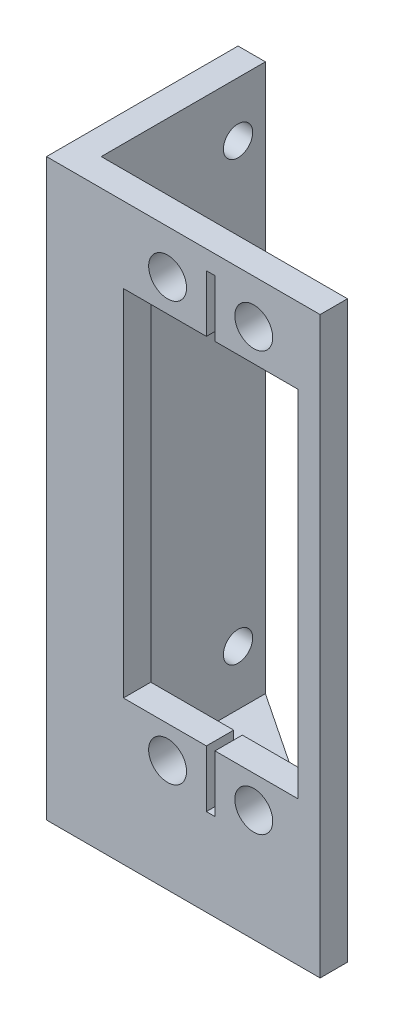
ISO-10303-21;
HEADER;
FILE_DESCRIPTION(('STEP AP214'),'2;1');
FILE_NAME('part.step','',(''),(''),'','','');
FILE_SCHEMA(('AUTOMOTIVE_DESIGN { 1 0 10303 214 1 1 1 1 }'));
ENDSEC;
DATA;
#1=APPLICATION_CONTEXT('core data for automotive mechanical design processes');
#2=APPLICATION_PROTOCOL_DEFINITION('international standard','automotive_design',2000,#1);
#3=PRODUCT_CONTEXT('',#1,'mechanical');
#4=PRODUCT('Part','Part','',(#3));
#5=PRODUCT_RELATED_PRODUCT_CATEGORY('part','',(#4));
#6=PRODUCT_DEFINITION_FORMATION('','',#4);
#7=PRODUCT_DEFINITION_CONTEXT('part definition',#1,'design');
#8=PRODUCT_DEFINITION('design','',#6,#7);
#9=PRODUCT_DEFINITION_SHAPE('','',#8);
#10=(LENGTH_UNIT() NAMED_UNIT(*) SI_UNIT(.MILLI.,.METRE.));
#11=(NAMED_UNIT(*) PLANE_ANGLE_UNIT() SI_UNIT($,.RADIAN.));
#12=(NAMED_UNIT(*) SI_UNIT($,.STERADIAN.) SOLID_ANGLE_UNIT());
#13=UNCERTAINTY_MEASURE_WITH_UNIT(LENGTH_MEASURE(1.E-05),#10,'distance_accuracy_value','');
#14=(GEOMETRIC_REPRESENTATION_CONTEXT(3) GLOBAL_UNCERTAINTY_ASSIGNED_CONTEXT((#13)) GLOBAL_UNIT_ASSIGNED_CONTEXT((#10,
#11,#12)) REPRESENTATION_CONTEXT('',''));
#15=CARTESIAN_POINT('',(0.,0.,0.));
#16=DIRECTION('',(0.,0.,1.));
#17=DIRECTION('',(1.,0.,0.));
#18=AXIS2_PLACEMENT_3D('',#15,#16,#17);
#19=CARTESIAN_POINT('',(31.75,0.,3.175));
#20=DIRECTION('',(-1.,0.,0.));
#21=DIRECTION('',(0.,-1.,0.));
#22=AXIS2_PLACEMENT_3D('',#19,#20,#21);
#23=PLANE('',#22);
#24=DIRECTION('',(0.,1.,0.));
#25=VECTOR('',#24,1.);
#26=CARTESIAN_POINT('',(31.75,0.,0.));
#27=LINE('',#26,#25);
#28=CARTESIAN_POINT('',(31.75,0.,0.));
#29=VERTEX_POINT('',#28);
#30=CARTESIAN_POINT('',(31.75,63.5,0.));
#31=VERTEX_POINT('',#30);
#32=EDGE_CURVE('E348',#29,#31,#27,.T.);
#33=ORIENTED_EDGE('',*,*,#32,.T.);
#34=DIRECTION('',(0.,0.,-1.));
#35=VECTOR('',#34,1.);
#36=CARTESIAN_POINT('',(31.75,63.5,3.175));
#37=LINE('',#36,#35);
#38=CARTESIAN_POINT('',(31.75,63.5,3.175));
#39=VERTEX_POINT('',#38);
#40=EDGE_CURVE('E11',#39,#31,#37,.T.);
#41=ORIENTED_EDGE('',*,*,#40,.F.);
#42=DIRECTION('',(0.,1.,0.));
#43=VECTOR('',#42,1.);
#44=CARTESIAN_POINT('',(31.75,0.,3.175));
#45=LINE('',#44,#43);
#46=CARTESIAN_POINT('',(31.75,-3.175,3.175));
#47=VERTEX_POINT('',#46);
#48=EDGE_CURVE('E338',#47,#39,#45,.T.);
#49=ORIENTED_EDGE('',*,*,#48,.F.);
#50=DIRECTION('',(0.,0.,1.));
#51=VECTOR('',#50,1.);
#52=CARTESIAN_POINT('',(31.75,-3.175,3.175));
#53=LINE('',#52,#51);
#54=CARTESIAN_POINT('',(31.75,-3.175,0.));
#55=VERTEX_POINT('',#54);
#56=EDGE_CURVE('E204',#55,#47,#53,.T.);
#57=ORIENTED_EDGE('',*,*,#56,.F.);
#58=DIRECTION('',(0.,1.,0.));
#59=VECTOR('',#58,1.);
#60=CARTESIAN_POINT('',(31.75,-3.175,0.));
#61=LINE('',#60,#59);
#62=EDGE_CURVE('E206',#55,#29,#61,.T.);
#63=ORIENTED_EDGE('',*,*,#62,.T.);
#64=EDGE_LOOP('',(#33,#41,#49,#57,#63));
#65=FACE_BOUND('',#64,.T.);
#66=ADVANCED_FACE('F37',(#65),#23,.F.);
#67=CARTESIAN_POINT('',(0.,63.5,3.175));
#68=DIRECTION('',(0.,1.,0.));
#69=DIRECTION('',(0.,0.,1.));
#70=AXIS2_PLACEMENT_3D('',#67,#68,#69);
#71=PLANE('',#70);
#72=DIRECTION('',(1.,0.,0.));
#73=VECTOR('',#72,1.);
#74=CARTESIAN_POINT('',(0.,63.5,0.));
#75=LINE('',#74,#73);
#76=CARTESIAN_POINT('',(3.175,63.5,0.));
#77=VERTEX_POINT('',#76);
#78=EDGE_CURVE('E341',#77,#31,#75,.T.);
#79=ORIENTED_EDGE('',*,*,#78,.F.);
#80=DIRECTION('',(0.,0.,1.));
#81=VECTOR('',#80,1.);
#82=CARTESIAN_POINT('',(3.175,63.5,-19.05));
#83=LINE('',#82,#81);
#84=CARTESIAN_POINT('',(3.175,63.5,-19.05));
#85=VERTEX_POINT('',#84);
#86=EDGE_CURVE('E51',#85,#77,#83,.T.);
#87=ORIENTED_EDGE('',*,*,#86,.F.);
#88=DIRECTION('',(-1.,0.,0.));
#89=VECTOR('',#88,1.);
#90=CARTESIAN_POINT('',(0.,63.5,-19.05));
#91=LINE('',#90,#89);
#92=CARTESIAN_POINT('',(0.,63.5,-19.05));
#93=VERTEX_POINT('',#92);
#94=EDGE_CURVE('E212',#85,#93,#91,.T.);
#95=ORIENTED_EDGE('',*,*,#94,.T.);
#96=DIRECTION('',(0.,0.,-1.));
#97=VECTOR('',#96,1.);
#98=CARTESIAN_POINT('',(0.,63.5,3.175));
#99=LINE('',#98,#97);
#100=CARTESIAN_POINT('',(0.,63.5,3.175));
#101=VERTEX_POINT('',#100);
#102=EDGE_CURVE('E44',#101,#93,#99,.T.);
#103=ORIENTED_EDGE('',*,*,#102,.F.);
#104=DIRECTION('',(1.,0.,0.));
#105=VECTOR('',#104,1.);
#106=CARTESIAN_POINT('',(0.,63.5,3.175));
#107=LINE('',#106,#105);
#108=EDGE_CURVE('E340',#101,#39,#107,.T.);
#109=ORIENTED_EDGE('',*,*,#108,.T.);
#110=ORIENTED_EDGE('',*,*,#40,.T.);
#111=EDGE_LOOP('',(#79,#87,#95,#103,#109,#110));
#112=FACE_BOUND('',#111,.T.);
#113=ADVANCED_FACE('F357',(#112),#71,.T.);
#114=CARTESIAN_POINT('',(0.,0.,3.175));
#115=DIRECTION('',(-1.,0.,0.));
#116=DIRECTION('',(0.,-1.,0.));
#117=AXIS2_PLACEMENT_3D('',#114,#115,#116);
#118=PLANE('',#117);
#119=CARTESIAN_POINT('',(0.,6.35,-3.175));
#120=DIRECTION('',(1.,0.,0.));
#121=DIRECTION('',(0.,1.,0.));
#122=AXIS2_PLACEMENT_3D('',#119,#120,#121);
#123=CIRCLE('',#122,1.700000029);
#124=CARTESIAN_POINT('',(0.,8.050000029,-3.175));
#125=VERTEX_POINT('',#124);
#126=EDGE_CURVE('E775',#125,#125,#123,.T.);
#127=ORIENTED_EDGE('',*,*,#126,.T.);
#128=EDGE_LOOP('',(#127));
#129=FACE_BOUND('',#128,.T.);
#130=CARTESIAN_POINT('',(0.,57.15,-15.875));
#131=DIRECTION('',(1.,0.,0.));
#132=DIRECTION('',(0.,1.,0.));
#133=AXIS2_PLACEMENT_3D('',#130,#131,#132);
#134=CIRCLE('',#133,1.700000029);
#135=CARTESIAN_POINT('',(0.,58.850000029,-15.875));
#136=VERTEX_POINT('',#135);
#137=EDGE_CURVE('E789',#136,#136,#134,.T.);
#138=ORIENTED_EDGE('',*,*,#137,.T.);
#139=EDGE_LOOP('',(#138));
#140=FACE_BOUND('',#139,.T.);
#141=CARTESIAN_POINT('',(0.,6.35,-15.875));
#142=DIRECTION('',(1.,0.,0.));
#143=DIRECTION('',(0.,1.,0.));
#144=AXIS2_PLACEMENT_3D('',#141,#142,#143);
#145=CIRCLE('',#144,1.700000029);
#146=CARTESIAN_POINT('',(0.,8.050000029,-15.875));
#147=VERTEX_POINT('',#146);
#148=EDGE_CURVE('E784',#147,#147,#145,.T.);
#149=ORIENTED_EDGE('',*,*,#148,.T.);
#150=EDGE_LOOP('',(#149));
#151=FACE_BOUND('',#150,.T.);
#152=CARTESIAN_POINT('',(0.,57.15,-3.175));
#153=DIRECTION('',(1.,0.,0.));
#154=DIRECTION('',(0.,1.,0.));
#155=AXIS2_PLACEMENT_3D('',#152,#153,#154);
#156=CIRCLE('',#155,1.700000029);
#157=CARTESIAN_POINT('',(0.,58.850000029,-3.175));
#158=VERTEX_POINT('',#157);
#159=EDGE_CURVE('E197',#158,#158,#156,.T.);
#160=ORIENTED_EDGE('',*,*,#159,.T.);
#161=EDGE_LOOP('',(#160));
#162=FACE_BOUND('',#161,.T.);
#163=ORIENTED_EDGE('',*,*,#102,.T.);
#164=DIRECTION('',(0.,-1.,0.));
#165=VECTOR('',#164,1.);
#166=CARTESIAN_POINT('',(0.,0.,-19.05));
#167=LINE('',#166,#165);
#168=CARTESIAN_POINT('',(0.,-3.175,-19.05));
#169=VERTEX_POINT('',#168);
#170=EDGE_CURVE('E167',#93,#169,#167,.T.);
#171=ORIENTED_EDGE('',*,*,#170,.T.);
#172=DIRECTION('',(0.,0.,-1.));
#173=VECTOR('',#172,1.);
#174=CARTESIAN_POINT('',(0.,-3.175,-19.05));
#175=LINE('',#174,#173);
#176=CARTESIAN_POINT('',(0.,-3.175,3.175));
#177=VERTEX_POINT('',#176);
#178=EDGE_CURVE('E172',#177,#169,#175,.T.);
#179=ORIENTED_EDGE('',*,*,#178,.F.);
#180=DIRECTION('',(0.,1.,0.));
#181=VECTOR('',#180,1.);
#182=CARTESIAN_POINT('',(0.,0.,3.175));
#183=LINE('',#182,#181);
#184=EDGE_CURVE('E344',#177,#101,#183,.T.);
#185=ORIENTED_EDGE('',*,*,#184,.T.);
#186=EDGE_LOOP('',(#163,#171,#179,#185));
#187=FACE_BOUND('',#186,.T.);
#188=ADVANCED_FACE('F169',(#129,#140,#151,#162,#187),#118,.T.);
#189=CARTESIAN_POINT('',(0.,0.,3.175));
#190=DIRECTION('',(0.,0.,1.));
#191=DIRECTION('',(1.,0.,0.));
#192=AXIS2_PLACEMENT_3D('',#189,#190,#191);
#193=PLANE('',#192);
#194=CARTESIAN_POINT('',(24.050000033,9.82700003100002,3.175));
#195=DIRECTION('',(0.,0.,1.));
#196=DIRECTION('',(1.,0.,0.));
#197=AXIS2_PLACEMENT_3D('',#194,#195,#196);
#198=CIRCLE('',#197,2.200000045);
#199=CARTESIAN_POINT('',(26.250000078,9.82700003100002,3.175));
#200=VERTEX_POINT('',#199);
#201=EDGE_CURVE('E320',#200,#200,#198,.T.);
#202=ORIENTED_EDGE('',*,*,#201,.F.);
#203=EDGE_LOOP('',(#202));
#204=FACE_BOUND('',#203,.T.);
#205=CARTESIAN_POINT('',(14.049999967,58.427000113,3.175));
#206=DIRECTION('',(0.,0.,1.));
#207=DIRECTION('',(1.,0.,0.));
#208=AXIS2_PLACEMENT_3D('',#205,#206,#207);
#209=CIRCLE('',#208,2.200000045);
#210=CARTESIAN_POINT('',(16.250000012,58.427000113,3.175));
#211=VERTEX_POINT('',#210);
#212=EDGE_CURVE('E327',#211,#211,#209,.T.);
#213=ORIENTED_EDGE('',*,*,#212,.F.);
#214=EDGE_LOOP('',(#213));
#215=FACE_BOUND('',#214,.T.);
#216=DIRECTION('',(0.,-1.,0.));
#217=VECTOR('',#216,1.);
#218=CARTESIAN_POINT('',(8.923000061,54.704000066,3.175));
#219=LINE('',#218,#217);
#220=CARTESIAN_POINT('',(8.923000061,54.704000066,3.175));
#221=VERTEX_POINT('',#220);
#222=CARTESIAN_POINT('',(8.923000061,13.550000078,3.175));
#223=VERTEX_POINT('',#222);
#224=EDGE_CURVE('E59',#221,#223,#219,.T.);
#225=ORIENTED_EDGE('',*,*,#224,.F.);
#226=DIRECTION('',(-1.,0.,0.));
#227=VECTOR('',#226,1.);
#228=CARTESIAN_POINT('',(8.923000061,54.704000066,3.175));
#229=LINE('',#228,#227);
#230=CARTESIAN_POINT('',(18.55,54.704000066,3.175));
#231=VERTEX_POINT('',#230);
#232=EDGE_CURVE('E244',#231,#221,#229,.T.);
#233=ORIENTED_EDGE('',*,*,#232,.F.);
#234=DIRECTION('',(0.,-1.,0.));
#235=VECTOR('',#234,1.);
#236=CARTESIAN_POINT('',(18.55,54.704000066,3.175));
#237=LINE('',#236,#235);
#238=CARTESIAN_POINT('',(18.55,61.308000066,3.175));
#239=VERTEX_POINT('',#238);
#240=EDGE_CURVE('E247',#239,#231,#237,.T.);
#241=ORIENTED_EDGE('',*,*,#240,.F.);
#242=DIRECTION('',(-1.,0.,0.));
#243=VECTOR('',#242,1.);
#244=CARTESIAN_POINT('',(18.55,61.308000066,3.175));
#245=LINE('',#244,#243);
#246=CARTESIAN_POINT('',(19.55,61.308000066,3.175));
#247=VERTEX_POINT('',#246);
#248=EDGE_CURVE('E251',#247,#239,#245,.T.);
#249=ORIENTED_EDGE('',*,*,#248,.F.);
#250=DIRECTION('',(0.,1.,0.));
#251=VECTOR('',#250,1.);
#252=CARTESIAN_POINT('',(19.55,54.704000066,3.175));
#253=LINE('',#252,#251);
#254=CARTESIAN_POINT('',(19.55,54.704000066,3.175));
#255=VERTEX_POINT('',#254);
#256=EDGE_CURVE('E254',#255,#247,#253,.T.);
#257=ORIENTED_EDGE('',*,*,#256,.F.);
#258=DIRECTION('',(-1.,0.,0.));
#259=VECTOR('',#258,1.);
#260=CARTESIAN_POINT('',(19.55,54.704000066,3.175));
#261=LINE('',#260,#259);
#262=CARTESIAN_POINT('',(29.176999939,54.704000066,3.175));
#263=VERTEX_POINT('',#262);
#264=EDGE_CURVE('E257',#263,#255,#261,.T.);
#265=ORIENTED_EDGE('',*,*,#264,.F.);
#266=DIRECTION('',(0.,1.,0.));
#267=VECTOR('',#266,1.);
#268=CARTESIAN_POINT('',(29.176999939,54.704000066,3.175));
#269=LINE('',#268,#267);
#270=CARTESIAN_POINT('',(29.176999939,13.550000078,3.175));
#271=VERTEX_POINT('',#270);
#272=EDGE_CURVE('E260',#271,#263,#269,.T.);
#273=ORIENTED_EDGE('',*,*,#272,.F.);
#274=DIRECTION('',(1.,0.,0.));
#275=VECTOR('',#274,1.);
#276=CARTESIAN_POINT('',(19.55,13.550000078,3.175));
#277=LINE('',#276,#275);
#278=CARTESIAN_POINT('',(19.55,13.550000078,3.175));
#279=VERTEX_POINT('',#278);
#280=EDGE_CURVE('E263',#279,#271,#277,.T.);
#281=ORIENTED_EDGE('',*,*,#280,.F.);
#282=DIRECTION('',(0.,1.,0.));
#283=VECTOR('',#282,1.);
#284=CARTESIAN_POINT('',(19.55,13.550000078,3.175));
#285=LINE('',#284,#283);
#286=CARTESIAN_POINT('',(19.55,6.94600007800001,3.175));
#287=VERTEX_POINT('',#286);
#288=EDGE_CURVE('E266',#287,#279,#285,.T.);
#289=ORIENTED_EDGE('',*,*,#288,.F.);
#290=DIRECTION('',(1.,0.,0.));
#291=VECTOR('',#290,1.);
#292=CARTESIAN_POINT('',(18.55,6.94600007800004,3.175));
#293=LINE('',#292,#291);
#294=CARTESIAN_POINT('',(18.55,6.94600007800004,3.175));
#295=VERTEX_POINT('',#294);
#296=EDGE_CURVE('E269',#295,#287,#293,.T.);
#297=ORIENTED_EDGE('',*,*,#296,.F.);
#298=DIRECTION('',(0.,-1.,0.));
#299=VECTOR('',#298,1.);
#300=CARTESIAN_POINT('',(18.55,13.550000078,3.175));
#301=LINE('',#300,#299);
#302=CARTESIAN_POINT('',(18.55,13.550000078,3.175));
#303=VERTEX_POINT('',#302);
#304=EDGE_CURVE('E272',#303,#295,#301,.T.);
#305=ORIENTED_EDGE('',*,*,#304,.F.);
#306=DIRECTION('',(1.,0.,0.));
#307=VECTOR('',#306,1.);
#308=CARTESIAN_POINT('',(8.923000061,13.550000078,3.175));
#309=LINE('',#308,#307);
#310=EDGE_CURVE('E275',#223,#303,#309,.T.);
#311=ORIENTED_EDGE('',*,*,#310,.F.);
#312=EDGE_LOOP('',(#225,#233,#241,#249,#257,#265,#273,#281,#289,#297,#305,#311));
#313=FACE_BOUND('',#312,.T.);
#314=CARTESIAN_POINT('',(24.050000033,58.427000113,3.175));
#315=DIRECTION('',(0.,0.,1.));
#316=DIRECTION('',(1.,0.,0.));
#317=AXIS2_PLACEMENT_3D('',#314,#315,#316);
#318=CIRCLE('',#317,2.200000045);
#319=CARTESIAN_POINT('',(26.250000078,58.427000113,3.175));
#320=VERTEX_POINT('',#319);
#321=EDGE_CURVE('E314',#320,#320,#318,.T.);
#322=ORIENTED_EDGE('',*,*,#321,.F.);
#323=EDGE_LOOP('',(#322));
#324=FACE_BOUND('',#323,.T.);
#325=CARTESIAN_POINT('',(14.049999967,9.82700003100002,3.175));
#326=DIRECTION('',(0.,0.,1.));
#327=DIRECTION('',(1.,0.,0.));
#328=AXIS2_PLACEMENT_3D('',#325,#326,#327);
#329=CIRCLE('',#328,2.200000045);
#330=CARTESIAN_POINT('',(16.250000012,9.82700003100002,3.175));
#331=VERTEX_POINT('',#330);
#332=EDGE_CURVE('E323',#331,#331,#329,.T.);
#333=ORIENTED_EDGE('',*,*,#332,.F.);
#334=EDGE_LOOP('',(#333));
#335=FACE_BOUND('',#334,.T.);
#336=ORIENTED_EDGE('',*,*,#184,.F.);
#337=DIRECTION('',(-1.,0.,0.));
#338=VECTOR('',#337,1.);
#339=CARTESIAN_POINT('',(0.,-3.175,3.175));
#340=LINE('',#339,#338);
#341=EDGE_CURVE('E193',#47,#177,#340,.T.);
#342=ORIENTED_EDGE('',*,*,#341,.F.);
#343=ORIENTED_EDGE('',*,*,#48,.T.);
#344=ORIENTED_EDGE('',*,*,#108,.F.);
#345=EDGE_LOOP('',(#336,#342,#343,#344));
#346=FACE_BOUND('',#345,.T.);
#347=ADVANCED_FACE('F369',(#204,#215,#313,#324,#335,#346),#193,.T.);
#348=CARTESIAN_POINT('',(0.,0.,0.));
#349=DIRECTION('',(0.,0.,1.));
#350=DIRECTION('',(1.,0.,0.));
#351=AXIS2_PLACEMENT_3D('',#348,#349,#350);
#352=PLANE('',#351);
#353=CARTESIAN_POINT('',(24.050000033,9.82700003100002,0.));
#354=DIRECTION('',(0.,0.,1.));
#355=DIRECTION('',(1.,0.,0.));
#356=AXIS2_PLACEMENT_3D('',#353,#354,#355);
#357=CIRCLE('',#356,2.200000045);
#358=CARTESIAN_POINT('',(26.250000078,9.82700003100002,0.));
#359=VERTEX_POINT('',#358);
#360=EDGE_CURVE('E324',#359,#359,#357,.T.);
#361=ORIENTED_EDGE('',*,*,#360,.T.);
#362=EDGE_LOOP('',(#361));
#363=FACE_BOUND('',#362,.T.);
#364=CARTESIAN_POINT('',(14.049999967,58.427000113,0.));
#365=DIRECTION('',(0.,0.,1.));
#366=DIRECTION('',(1.,0.,0.));
#367=AXIS2_PLACEMENT_3D('',#364,#365,#366);
#368=CIRCLE('',#367,2.200000045);
#369=CARTESIAN_POINT('',(16.250000012,58.427000113,0.));
#370=VERTEX_POINT('',#369);
#371=EDGE_CURVE('E317',#370,#370,#368,.T.);
#372=ORIENTED_EDGE('',*,*,#371,.T.);
#373=EDGE_LOOP('',(#372));
#374=FACE_BOUND('',#373,.T.);
#375=DIRECTION('',(-1.,0.,0.));
#376=VECTOR('',#375,1.);
#377=CARTESIAN_POINT('',(8.923000061,54.704000066,0.));
#378=LINE('',#377,#376);
#379=CARTESIAN_POINT('',(18.55,54.704000066,0.));
#380=VERTEX_POINT('',#379);
#381=CARTESIAN_POINT('',(8.923000061,54.704000066,0.));
#382=VERTEX_POINT('',#381);
#383=EDGE_CURVE('E222',#380,#382,#378,.T.);
#384=ORIENTED_EDGE('',*,*,#383,.T.);
#385=DIRECTION('',(0.,-1.,0.));
#386=VECTOR('',#385,1.);
#387=CARTESIAN_POINT('',(8.923000061,54.704000066,0.));
#388=LINE('',#387,#386);
#389=CARTESIAN_POINT('',(8.923000061,13.550000078,0.));
#390=VERTEX_POINT('',#389);
#391=EDGE_CURVE('E248',#382,#390,#388,.T.);
#392=ORIENTED_EDGE('',*,*,#391,.T.);
#393=DIRECTION('',(1.,0.,0.));
#394=VECTOR('',#393,1.);
#395=CARTESIAN_POINT('',(8.923000061,13.550000078,0.));
#396=LINE('',#395,#394);
#397=CARTESIAN_POINT('',(18.55,13.550000078,0.));
#398=VERTEX_POINT('',#397);
#399=EDGE_CURVE('E309',#390,#398,#396,.T.);
#400=ORIENTED_EDGE('',*,*,#399,.T.);
#401=DIRECTION('',(0.,-1.,0.));
#402=VECTOR('',#401,1.);
#403=CARTESIAN_POINT('',(18.55,13.550000078,0.));
#404=LINE('',#403,#402);
#405=CARTESIAN_POINT('',(18.55,6.94600007800004,0.));
#406=VERTEX_POINT('',#405);
#407=EDGE_CURVE('E306',#398,#406,#404,.T.);
#408=ORIENTED_EDGE('',*,*,#407,.T.);
#409=DIRECTION('',(1.,0.,0.));
#410=VECTOR('',#409,1.);
#411=CARTESIAN_POINT('',(18.55,6.94600007800004,0.));
#412=LINE('',#411,#410);
#413=CARTESIAN_POINT('',(19.55,6.94600007800001,0.));
#414=VERTEX_POINT('',#413);
#415=EDGE_CURVE('E303',#406,#414,#412,.T.);
#416=ORIENTED_EDGE('',*,*,#415,.T.);
#417=DIRECTION('',(0.,1.,0.));
#418=VECTOR('',#417,1.);
#419=CARTESIAN_POINT('',(19.55,13.550000078,0.));
#420=LINE('',#419,#418);
#421=CARTESIAN_POINT('',(19.55,13.550000078,0.));
#422=VERTEX_POINT('',#421);
#423=EDGE_CURVE('E300',#414,#422,#420,.T.);
#424=ORIENTED_EDGE('',*,*,#423,.T.);
#425=DIRECTION('',(1.,0.,0.));
#426=VECTOR('',#425,1.);
#427=CARTESIAN_POINT('',(19.55,13.550000078,0.));
#428=LINE('',#427,#426);
#429=CARTESIAN_POINT('',(29.176999939,13.550000078,0.));
#430=VERTEX_POINT('',#429);
#431=EDGE_CURVE('E297',#422,#430,#428,.T.);
#432=ORIENTED_EDGE('',*,*,#431,.T.);
#433=DIRECTION('',(0.,1.,0.));
#434=VECTOR('',#433,1.);
#435=CARTESIAN_POINT('',(29.176999939,54.704000066,0.));
#436=LINE('',#435,#434);
#437=CARTESIAN_POINT('',(29.176999939,54.704000066,0.));
#438=VERTEX_POINT('',#437);
#439=EDGE_CURVE('E294',#430,#438,#436,.T.);
#440=ORIENTED_EDGE('',*,*,#439,.T.);
#441=DIRECTION('',(-1.,0.,0.));
#442=VECTOR('',#441,1.);
#443=CARTESIAN_POINT('',(19.55,54.704000066,0.));
#444=LINE('',#443,#442);
#445=CARTESIAN_POINT('',(19.55,54.704000066,0.));
#446=VERTEX_POINT('',#445);
#447=EDGE_CURVE('E291',#438,#446,#444,.T.);
#448=ORIENTED_EDGE('',*,*,#447,.T.);
#449=DIRECTION('',(0.,1.,0.));
#450=VECTOR('',#449,1.);
#451=CARTESIAN_POINT('',(19.55,54.704000066,0.));
#452=LINE('',#451,#450);
#453=CARTESIAN_POINT('',(19.55,61.308000066,0.));
#454=VERTEX_POINT('',#453);
#455=EDGE_CURVE('E288',#446,#454,#452,.T.);
#456=ORIENTED_EDGE('',*,*,#455,.T.);
#457=DIRECTION('',(-1.,0.,0.));
#458=VECTOR('',#457,1.);
#459=CARTESIAN_POINT('',(18.55,61.308000066,0.));
#460=LINE('',#459,#458);
#461=CARTESIAN_POINT('',(18.55,61.308000066,0.));
#462=VERTEX_POINT('',#461);
#463=EDGE_CURVE('E285',#454,#462,#460,.T.);
#464=ORIENTED_EDGE('',*,*,#463,.T.);
#465=DIRECTION('',(0.,-1.,0.));
#466=VECTOR('',#465,1.);
#467=CARTESIAN_POINT('',(18.55,54.704000066,0.));
#468=LINE('',#467,#466);
#469=EDGE_CURVE('E282',#462,#380,#468,.T.);
#470=ORIENTED_EDGE('',*,*,#469,.T.);
#471=EDGE_LOOP('',(#384,#392,#400,#408,#416,#424,#432,#440,#448,#456,#464,#470));
#472=FACE_BOUND('',#471,.T.);
#473=CARTESIAN_POINT('',(24.050000033,58.427000113,0.));
#474=DIRECTION('',(0.,0.,1.));
#475=DIRECTION('',(1.,0.,0.));
#476=AXIS2_PLACEMENT_3D('',#473,#474,#475);
#477=CIRCLE('',#476,2.200000045);
#478=CARTESIAN_POINT('',(26.250000078,58.427000113,0.));
#479=VERTEX_POINT('',#478);
#480=EDGE_CURVE('E279',#479,#479,#477,.T.);
#481=ORIENTED_EDGE('',*,*,#480,.T.);
#482=EDGE_LOOP('',(#481));
#483=FACE_BOUND('',#482,.T.);
#484=CARTESIAN_POINT('',(14.049999967,9.82700003100002,0.));
#485=DIRECTION('',(0.,0.,1.));
#486=DIRECTION('',(1.,0.,0.));
#487=AXIS2_PLACEMENT_3D('',#484,#485,#486);
#488=CIRCLE('',#487,2.200000045);
#489=CARTESIAN_POINT('',(16.250000012,9.82700003100002,0.));
#490=VERTEX_POINT('',#489);
#491=EDGE_CURVE('E332',#490,#490,#488,.T.);
#492=ORIENTED_EDGE('',*,*,#491,.T.);
#493=EDGE_LOOP('',(#492));
#494=FACE_BOUND('',#493,.T.);
#495=DIRECTION('',(1.,0.,0.));
#496=VECTOR('',#495,1.);
#497=CARTESIAN_POINT('',(0.,0.,0.));
#498=LINE('',#497,#496);
#499=CARTESIAN_POINT('',(3.17500000000001,0.,0.));
#500=VERTEX_POINT('',#499);
#501=EDGE_CURVE('E335',#500,#29,#498,.T.);
#502=ORIENTED_EDGE('',*,*,#501,.F.);
#503=DIRECTION('',(0.,1.,0.));
#504=VECTOR('',#503,1.);
#505=CARTESIAN_POINT('',(3.17500000000001,0.,0.));
#506=LINE('',#505,#504);
#507=EDGE_CURVE('E177',#500,#77,#506,.T.);
#508=ORIENTED_EDGE('',*,*,#507,.T.);
#509=ORIENTED_EDGE('',*,*,#78,.T.);
#510=ORIENTED_EDGE('',*,*,#32,.F.);
#511=EDGE_LOOP('',(#502,#508,#509,#510));
#512=FACE_BOUND('',#511,.T.);
#513=ADVANCED_FACE('F354',(#363,#374,#472,#483,#494,#512),#352,.F.);
#514=CARTESIAN_POINT('',(14.049999967,9.82700003100002,0.));
#515=DIRECTION('',(0.,0.,1.));
#516=DIRECTION('',(1.,0.,0.));
#517=AXIS2_PLACEMENT_3D('',#514,#515,#516);
#518=CYLINDRICAL_SURFACE('',#517,2.200000045);
#519=ORIENTED_EDGE('',*,*,#491,.F.);
#520=EDGE_LOOP('',(#519));
#521=FACE_BOUND('',#520,.T.);
#522=ORIENTED_EDGE('',*,*,#332,.T.);
#523=EDGE_LOOP('',(#522));
#524=FACE_BOUND('',#523,.T.);
#525=ADVANCED_FACE('F377',(#521,#524),#518,.F.);
#526=CARTESIAN_POINT('',(24.050000033,58.427000113,0.));
#527=DIRECTION('',(0.,0.,1.));
#528=DIRECTION('',(1.,0.,0.));
#529=AXIS2_PLACEMENT_3D('',#526,#527,#528);
#530=CYLINDRICAL_SURFACE('',#529,2.200000045);
#531=ORIENTED_EDGE('',*,*,#480,.F.);
#532=EDGE_LOOP('',(#531));
#533=FACE_BOUND('',#532,.T.);
#534=ORIENTED_EDGE('',*,*,#321,.T.);
#535=EDGE_LOOP('',(#534));
#536=FACE_BOUND('',#535,.T.);
#537=ADVANCED_FACE('F630',(#533,#536),#530,.F.);
#538=CARTESIAN_POINT('',(8.923000061,54.704000066,0.));
#539=DIRECTION('',(-1.,0.,0.));
#540=DIRECTION('',(0.,0.,1.));
#541=AXIS2_PLACEMENT_3D('',#538,#539,#540);
#542=PLANE('',#541);
#543=ORIENTED_EDGE('',*,*,#224,.T.);
#544=DIRECTION('',(0.,0.,1.));
#545=VECTOR('',#544,1.);
#546=CARTESIAN_POINT('',(8.923000061,13.550000078,0.));
#547=LINE('',#546,#545);
#548=EDGE_CURVE('E220',#390,#223,#547,.T.);
#549=ORIENTED_EDGE('',*,*,#548,.F.);
#550=ORIENTED_EDGE('',*,*,#391,.F.);
#551=DIRECTION('',(0.,0.,1.));
#552=VECTOR('',#551,1.);
#553=CARTESIAN_POINT('',(8.923000061,54.704000066,0.));
#554=LINE('',#553,#552);
#555=EDGE_CURVE('E217',#382,#221,#554,.T.);
#556=ORIENTED_EDGE('',*,*,#555,.T.);
#557=EDGE_LOOP('',(#543,#549,#550,#556));
#558=FACE_BOUND('',#557,.T.);
#559=ADVANCED_FACE('F620',(#558),#542,.F.);
#560=CARTESIAN_POINT('',(8.923000061,54.704000066,0.));
#561=DIRECTION('',(0.,1.,0.));
#562=DIRECTION('',(0.,0.,1.));
#563=AXIS2_PLACEMENT_3D('',#560,#561,#562);
#564=PLANE('',#563);
#565=ORIENTED_EDGE('',*,*,#232,.T.);
#566=ORIENTED_EDGE('',*,*,#555,.F.);
#567=ORIENTED_EDGE('',*,*,#383,.F.);
#568=DIRECTION('',(0.,0.,1.));
#569=VECTOR('',#568,1.);
#570=CARTESIAN_POINT('',(18.55,54.704000066,0.));
#571=LINE('',#570,#569);
#572=EDGE_CURVE('E241',#380,#231,#571,.T.);
#573=ORIENTED_EDGE('',*,*,#572,.T.);
#574=EDGE_LOOP('',(#565,#566,#567,#573));
#575=FACE_BOUND('',#574,.T.);
#576=ADVANCED_FACE('F610',(#575),#564,.F.);
#577=CARTESIAN_POINT('',(18.55,54.704000066,0.));
#578=DIRECTION('',(-1.,0.,0.));
#579=DIRECTION('',(0.,0.,1.));
#580=AXIS2_PLACEMENT_3D('',#577,#578,#579);
#581=PLANE('',#580);
#582=ORIENTED_EDGE('',*,*,#240,.T.);
#583=ORIENTED_EDGE('',*,*,#572,.F.);
#584=ORIENTED_EDGE('',*,*,#469,.F.);
#585=DIRECTION('',(0.,0.,1.));
#586=VECTOR('',#585,1.);
#587=CARTESIAN_POINT('',(18.55,61.308000066,0.));
#588=LINE('',#587,#586);
#589=EDGE_CURVE('E239',#462,#239,#588,.T.);
#590=ORIENTED_EDGE('',*,*,#589,.T.);
#591=EDGE_LOOP('',(#582,#583,#584,#590));
#592=FACE_BOUND('',#591,.T.);
#593=ADVANCED_FACE('F600',(#592),#581,.F.);
#594=CARTESIAN_POINT('',(18.55,61.308000066,0.));
#595=DIRECTION('',(0.,1.,0.));
#596=DIRECTION('',(0.,0.,1.));
#597=AXIS2_PLACEMENT_3D('',#594,#595,#596);
#598=PLANE('',#597);
#599=ORIENTED_EDGE('',*,*,#248,.T.);
#600=ORIENTED_EDGE('',*,*,#589,.F.);
#601=ORIENTED_EDGE('',*,*,#463,.F.);
#602=DIRECTION('',(0.,0.,1.));
#603=VECTOR('',#602,1.);
#604=CARTESIAN_POINT('',(19.55,61.308000066,0.));
#605=LINE('',#604,#603);
#606=EDGE_CURVE('E237',#454,#247,#605,.T.);
#607=ORIENTED_EDGE('',*,*,#606,.T.);
#608=EDGE_LOOP('',(#599,#600,#601,#607));
#609=FACE_BOUND('',#608,.T.);
#610=ADVANCED_FACE('F590',(#609),#598,.F.);
#611=CARTESIAN_POINT('',(19.55,54.704000066,0.));
#612=DIRECTION('',(1.,0.,0.));
#613=DIRECTION('',(0.,0.,-1.));
#614=AXIS2_PLACEMENT_3D('',#611,#612,#613);
#615=PLANE('',#614);
#616=ORIENTED_EDGE('',*,*,#256,.T.);
#617=ORIENTED_EDGE('',*,*,#606,.F.);
#618=ORIENTED_EDGE('',*,*,#455,.F.);
#619=DIRECTION('',(0.,0.,1.));
#620=VECTOR('',#619,1.);
#621=CARTESIAN_POINT('',(19.55,54.704000066,0.));
#622=LINE('',#621,#620);
#623=EDGE_CURVE('E235',#446,#255,#622,.T.);
#624=ORIENTED_EDGE('',*,*,#623,.T.);
#625=EDGE_LOOP('',(#616,#617,#618,#624));
#626=FACE_BOUND('',#625,.T.);
#627=ADVANCED_FACE('F580',(#626),#615,.F.);
#628=CARTESIAN_POINT('',(19.55,54.704000066,0.));
#629=DIRECTION('',(0.,1.,0.));
#630=DIRECTION('',(0.,0.,1.));
#631=AXIS2_PLACEMENT_3D('',#628,#629,#630);
#632=PLANE('',#631);
#633=ORIENTED_EDGE('',*,*,#264,.T.);
#634=ORIENTED_EDGE('',*,*,#623,.F.);
#635=ORIENTED_EDGE('',*,*,#447,.F.);
#636=DIRECTION('',(0.,0.,1.));
#637=VECTOR('',#636,1.);
#638=CARTESIAN_POINT('',(29.176999939,54.704000066,0.));
#639=LINE('',#638,#637);
#640=EDGE_CURVE('E233',#438,#263,#639,.T.);
#641=ORIENTED_EDGE('',*,*,#640,.T.);
#642=EDGE_LOOP('',(#633,#634,#635,#641));
#643=FACE_BOUND('',#642,.T.);
#644=ADVANCED_FACE('F570',(#643),#632,.F.);
#645=CARTESIAN_POINT('',(29.176999939,54.704000066,0.));
#646=DIRECTION('',(1.,0.,0.));
#647=DIRECTION('',(0.,0.,-1.));
#648=AXIS2_PLACEMENT_3D('',#645,#646,#647);
#649=PLANE('',#648);
#650=ORIENTED_EDGE('',*,*,#272,.T.);
#651=ORIENTED_EDGE('',*,*,#640,.F.);
#652=ORIENTED_EDGE('',*,*,#439,.F.);
#653=DIRECTION('',(0.,0.,1.));
#654=VECTOR('',#653,1.);
#655=CARTESIAN_POINT('',(29.176999939,13.550000078,0.));
#656=LINE('',#655,#654);
#657=EDGE_CURVE('E231',#430,#271,#656,.T.);
#658=ORIENTED_EDGE('',*,*,#657,.T.);
#659=EDGE_LOOP('',(#650,#651,#652,#658));
#660=FACE_BOUND('',#659,.T.);
#661=ADVANCED_FACE('F560',(#660),#649,.F.);
#662=CARTESIAN_POINT('',(19.55,13.550000078,0.));
#663=DIRECTION('',(0.,-1.,0.));
#664=DIRECTION('',(0.,0.,-1.));
#665=AXIS2_PLACEMENT_3D('',#662,#663,#664);
#666=PLANE('',#665);
#667=ORIENTED_EDGE('',*,*,#280,.T.);
#668=ORIENTED_EDGE('',*,*,#657,.F.);
#669=ORIENTED_EDGE('',*,*,#431,.F.);
#670=DIRECTION('',(0.,0.,1.));
#671=VECTOR('',#670,1.);
#672=CARTESIAN_POINT('',(19.55,13.550000078,0.));
#673=LINE('',#672,#671);
#674=EDGE_CURVE('E229',#422,#279,#673,.T.);
#675=ORIENTED_EDGE('',*,*,#674,.T.);
#676=EDGE_LOOP('',(#667,#668,#669,#675));
#677=FACE_BOUND('',#676,.T.);
#678=ADVANCED_FACE('F550',(#677),#666,.F.);
#679=CARTESIAN_POINT('',(19.55,13.550000078,0.));
#680=DIRECTION('',(1.,0.,0.));
#681=DIRECTION('',(0.,1.,0.));
#682=AXIS2_PLACEMENT_3D('',#679,#680,#681);
#683=PLANE('',#682);
#684=ORIENTED_EDGE('',*,*,#288,.T.);
#685=ORIENTED_EDGE('',*,*,#674,.F.);
#686=ORIENTED_EDGE('',*,*,#423,.F.);
#687=DIRECTION('',(0.,0.,1.));
#688=VECTOR('',#687,1.);
#689=CARTESIAN_POINT('',(19.55,6.94600007800001,0.));
#690=LINE('',#689,#688);
#691=EDGE_CURVE('E227',#414,#287,#690,.T.);
#692=ORIENTED_EDGE('',*,*,#691,.T.);
#693=EDGE_LOOP('',(#684,#685,#686,#692));
#694=FACE_BOUND('',#693,.T.);
#695=ADVANCED_FACE('F540',(#694),#683,.F.);
#696=CARTESIAN_POINT('',(18.55,6.94600007800004,0.));
#697=DIRECTION('',(0.,-1.,0.));
#698=DIRECTION('',(1.,0.,0.));
#699=AXIS2_PLACEMENT_3D('',#696,#697,#698);
#700=PLANE('',#699);
#701=ORIENTED_EDGE('',*,*,#296,.T.);
#702=ORIENTED_EDGE('',*,*,#691,.F.);
#703=ORIENTED_EDGE('',*,*,#415,.F.);
#704=DIRECTION('',(0.,0.,1.));
#705=VECTOR('',#704,1.);
#706=CARTESIAN_POINT('',(18.55,6.94600007800004,0.));
#707=LINE('',#706,#705);
#708=EDGE_CURVE('E225',#406,#295,#707,.T.);
#709=ORIENTED_EDGE('',*,*,#708,.T.);
#710=EDGE_LOOP('',(#701,#702,#703,#709));
#711=FACE_BOUND('',#710,.T.);
#712=ADVANCED_FACE('F530',(#711),#700,.F.);
#713=CARTESIAN_POINT('',(18.55,13.550000078,0.));
#714=DIRECTION('',(-1.,0.,0.));
#715=DIRECTION('',(0.,0.,1.));
#716=AXIS2_PLACEMENT_3D('',#713,#714,#715);
#717=PLANE('',#716);
#718=ORIENTED_EDGE('',*,*,#304,.T.);
#719=ORIENTED_EDGE('',*,*,#708,.F.);
#720=ORIENTED_EDGE('',*,*,#407,.F.);
#721=DIRECTION('',(0.,0.,1.));
#722=VECTOR('',#721,1.);
#723=CARTESIAN_POINT('',(18.55,13.550000078,0.));
#724=LINE('',#723,#722);
#725=EDGE_CURVE('E223',#398,#303,#724,.T.);
#726=ORIENTED_EDGE('',*,*,#725,.T.);
#727=EDGE_LOOP('',(#718,#719,#720,#726));
#728=FACE_BOUND('',#727,.T.);
#729=ADVANCED_FACE('F520',(#728),#717,.F.);
#730=CARTESIAN_POINT('',(8.923000061,13.550000078,0.));
#731=DIRECTION('',(0.,-1.,0.));
#732=DIRECTION('',(0.,0.,-1.));
#733=AXIS2_PLACEMENT_3D('',#730,#731,#732);
#734=PLANE('',#733);
#735=ORIENTED_EDGE('',*,*,#310,.T.);
#736=ORIENTED_EDGE('',*,*,#725,.F.);
#737=ORIENTED_EDGE('',*,*,#399,.F.);
#738=ORIENTED_EDGE('',*,*,#548,.T.);
#739=EDGE_LOOP('',(#735,#736,#737,#738));
#740=FACE_BOUND('',#739,.T.);
#741=ADVANCED_FACE('F510',(#740),#734,.F.);
#742=CARTESIAN_POINT('',(14.049999967,58.427000113,0.));
#743=DIRECTION('',(0.,0.,1.));
#744=DIRECTION('',(1.,0.,0.));
#745=AXIS2_PLACEMENT_3D('',#742,#743,#744);
#746=CYLINDRICAL_SURFACE('',#745,2.200000045);
#747=ORIENTED_EDGE('',*,*,#371,.F.);
#748=EDGE_LOOP('',(#747));
#749=FACE_BOUND('',#748,.T.);
#750=ORIENTED_EDGE('',*,*,#212,.T.);
#751=EDGE_LOOP('',(#750));
#752=FACE_BOUND('',#751,.T.);
#753=ADVANCED_FACE('F501',(#749,#752),#746,.F.);
#754=CARTESIAN_POINT('',(24.050000033,9.82700003100002,0.));
#755=DIRECTION('',(0.,0.,1.));
#756=DIRECTION('',(1.,0.,0.));
#757=AXIS2_PLACEMENT_3D('',#754,#755,#756);
#758=CYLINDRICAL_SURFACE('',#757,2.200000045);
#759=ORIENTED_EDGE('',*,*,#360,.F.);
#760=EDGE_LOOP('',(#759));
#761=FACE_BOUND('',#760,.T.);
#762=ORIENTED_EDGE('',*,*,#201,.T.);
#763=EDGE_LOOP('',(#762));
#764=FACE_BOUND('',#763,.T.);
#765=ADVANCED_FACE('F413',(#761,#764),#758,.F.);
#766=CARTESIAN_POINT('',(3.17500000000001,0.,-19.05));
#767=DIRECTION('',(1.,0.,0.));
#768=DIRECTION('',(0.,1.,0.));
#769=AXIS2_PLACEMENT_3D('',#766,#767,#768);
#770=PLANE('',#769);
#771=CARTESIAN_POINT('',(3.17500000000001,6.35,-3.175));
#772=DIRECTION('',(1.,0.,0.));
#773=DIRECTION('',(0.,1.,0.));
#774=AXIS2_PLACEMENT_3D('',#771,#772,#773);
#775=CIRCLE('',#774,1.700000029);
#776=CARTESIAN_POINT('',(3.17500000000001,8.050000029,-3.175));
#777=VERTEX_POINT('',#776);
#778=EDGE_CURVE('E778',#777,#777,#775,.T.);
#779=ORIENTED_EDGE('',*,*,#778,.F.);
#780=EDGE_LOOP('',(#779));
#781=FACE_BOUND('',#780,.T.);
#782=CARTESIAN_POINT('',(3.175,57.15,-15.875));
#783=DIRECTION('',(1.,0.,0.));
#784=DIRECTION('',(0.,1.,0.));
#785=AXIS2_PLACEMENT_3D('',#782,#783,#784);
#786=CIRCLE('',#785,1.700000029);
#787=CARTESIAN_POINT('',(3.175,58.850000029,-15.875));
#788=VERTEX_POINT('',#787);
#789=EDGE_CURVE('E781',#788,#788,#786,.T.);
#790=ORIENTED_EDGE('',*,*,#789,.F.);
#791=EDGE_LOOP('',(#790));
#792=FACE_BOUND('',#791,.T.);
#793=CARTESIAN_POINT('',(3.17500000000001,6.35,-15.875));
#794=DIRECTION('',(1.,0.,0.));
#795=DIRECTION('',(0.,1.,0.));
#796=AXIS2_PLACEMENT_3D('',#793,#794,#795);
#797=CIRCLE('',#796,1.700000029);
#798=CARTESIAN_POINT('',(3.17500000000001,8.050000029,-15.875));
#799=VERTEX_POINT('',#798);
#800=EDGE_CURVE('E791',#799,#799,#797,.T.);
#801=ORIENTED_EDGE('',*,*,#800,.F.);
#802=EDGE_LOOP('',(#801));
#803=FACE_BOUND('',#802,.T.);
#804=CARTESIAN_POINT('',(3.175,57.15,-3.175));
#805=DIRECTION('',(1.,0.,0.));
#806=DIRECTION('',(0.,1.,0.));
#807=AXIS2_PLACEMENT_3D('',#804,#805,#806);
#808=CIRCLE('',#807,1.700000029);
#809=CARTESIAN_POINT('',(3.175,58.850000029,-3.175));
#810=VERTEX_POINT('',#809);
#811=EDGE_CURVE('E200',#810,#810,#808,.T.);
#812=ORIENTED_EDGE('',*,*,#811,.F.);
#813=EDGE_LOOP('',(#812));
#814=FACE_BOUND('',#813,.T.);
#815=ORIENTED_EDGE('',*,*,#507,.F.);
#816=DIRECTION('',(0.,0.,1.));
#817=VECTOR('',#816,1.);
#818=CARTESIAN_POINT('',(3.17500000000001,0.,-19.05));
#819=LINE('',#818,#817);
#820=CARTESIAN_POINT('',(3.17500000000001,0.,-19.05));
#821=VERTEX_POINT('',#820);
#822=EDGE_CURVE('E214',#821,#500,#819,.T.);
#823=ORIENTED_EDGE('',*,*,#822,.F.);
#824=DIRECTION('',(0.,1.,0.));
#825=VECTOR('',#824,1.);
#826=CARTESIAN_POINT('',(3.17500000000001,0.,-19.05));
#827=LINE('',#826,#825);
#828=EDGE_CURVE('E176',#821,#85,#827,.T.);
#829=ORIENTED_EDGE('',*,*,#828,.T.);
#830=ORIENTED_EDGE('',*,*,#86,.T.);
#831=EDGE_LOOP('',(#815,#823,#829,#830));
#832=FACE_BOUND('',#831,.T.);
#833=ADVANCED_FACE('F367',(#781,#792,#803,#814,#832),#770,.T.);
#834=CARTESIAN_POINT('',(0.,0.,-19.05));
#835=DIRECTION('',(0.,0.,1.));
#836=DIRECTION('',(1.,0.,0.));
#837=AXIS2_PLACEMENT_3D('',#834,#835,#836);
#838=PLANE('',#837);
#839=ORIENTED_EDGE('',*,*,#170,.F.);
#840=ORIENTED_EDGE('',*,*,#94,.F.);
#841=ORIENTED_EDGE('',*,*,#828,.F.);
#842=DIRECTION('',(0.,1.,0.));
#843=VECTOR('',#842,1.);
#844=CARTESIAN_POINT('',(3.17500000000001,-3.175,-19.05));
#845=LINE('',#844,#843);
#846=CARTESIAN_POINT('',(3.17500000000001,-3.175,-19.05));
#847=VERTEX_POINT('',#846);
#848=EDGE_CURVE('E184',#847,#821,#845,.T.);
#849=ORIENTED_EDGE('',*,*,#848,.F.);
#850=DIRECTION('',(1.,0.,0.));
#851=VECTOR('',#850,1.);
#852=CARTESIAN_POINT('',(3.17500000000001,-3.175,-19.05));
#853=LINE('',#852,#851);
#854=EDGE_CURVE('E180',#169,#847,#853,.T.);
#855=ORIENTED_EDGE('',*,*,#854,.F.);
#856=EDGE_LOOP('',(#839,#840,#841,#849,#855));
#857=FACE_BOUND('',#856,.T.);
#858=ADVANCED_FACE('F181',(#857),#838,.F.);
#859=CARTESIAN_POINT('',(31.75,-3.175,0.));
#860=DIRECTION('',(-0.554700196225229,0.,0.832050294337844));
#861=DIRECTION('',(0.832050294337844,0.,0.554700196225229));
#862=AXIS2_PLACEMENT_3D('',#859,#860,#861);
#863=PLANE('',#862);
#864=DIRECTION('',(0.832050294337844,0.,0.554700196225229));
#865=VECTOR('',#864,1.);
#866=CARTESIAN_POINT('',(31.75,0.,0.));
#867=LINE('',#866,#865);
#868=EDGE_CURVE('E194',#821,#29,#867,.T.);
#869=ORIENTED_EDGE('',*,*,#868,.T.);
#870=ORIENTED_EDGE('',*,*,#62,.F.);
#871=DIRECTION('',(0.832050294337844,0.,0.554700196225229));
#872=VECTOR('',#871,1.);
#873=CARTESIAN_POINT('',(31.75,-3.175,0.));
#874=LINE('',#873,#872);
#875=EDGE_CURVE('E187',#847,#55,#874,.T.);
#876=ORIENTED_EDGE('',*,*,#875,.F.);
#877=ORIENTED_EDGE('',*,*,#848,.T.);
#878=EDGE_LOOP('',(#869,#870,#876,#877));
#879=FACE_BOUND('',#878,.T.);
#880=ADVANCED_FACE('F363',(#879),#863,.F.);
#881=CARTESIAN_POINT('',(0.,-3.175,0.));
#882=DIRECTION('',(0.,1.,0.));
#883=DIRECTION('',(0.,0.,1.));
#884=AXIS2_PLACEMENT_3D('',#881,#882,#883);
#885=PLANE('',#884);
#886=ORIENTED_EDGE('',*,*,#178,.T.);
#887=ORIENTED_EDGE('',*,*,#854,.T.);
#888=ORIENTED_EDGE('',*,*,#875,.T.);
#889=ORIENTED_EDGE('',*,*,#56,.T.);
#890=ORIENTED_EDGE('',*,*,#341,.T.);
#891=EDGE_LOOP('',(#886,#887,#888,#889,#890));
#892=FACE_BOUND('',#891,.T.);
#893=ADVANCED_FACE('F190',(#892),#885,.F.);
#894=CARTESIAN_POINT('',(0.,0.,0.));
#895=DIRECTION('',(0.,1.,0.));
#896=DIRECTION('',(0.,0.,1.));
#897=AXIS2_PLACEMENT_3D('',#894,#895,#896);
#898=PLANE('',#897);
#899=ORIENTED_EDGE('',*,*,#868,.F.);
#900=ORIENTED_EDGE('',*,*,#822,.T.);
#901=ORIENTED_EDGE('',*,*,#501,.T.);
#902=EDGE_LOOP('',(#899,#900,#901));
#903=FACE_BOUND('',#902,.T.);
#904=ADVANCED_FACE('F366',(#903),#898,.T.);
#905=CARTESIAN_POINT('',(0.,57.15,-3.175));
#906=DIRECTION('',(1.,0.,0.));
#907=DIRECTION('',(0.,1.,0.));
#908=AXIS2_PLACEMENT_3D('',#905,#906,#907);
#909=CYLINDRICAL_SURFACE('',#908,1.700000029);
#910=ORIENTED_EDGE('',*,*,#159,.F.);
#911=EDGE_LOOP('',(#910));
#912=FACE_BOUND('',#911,.T.);
#913=ORIENTED_EDGE('',*,*,#811,.T.);
#914=EDGE_LOOP('',(#913));
#915=FACE_BOUND('',#914,.T.);
#916=ADVANCED_FACE('F423',(#912,#915),#909,.F.);
#917=CARTESIAN_POINT('',(0.,6.35,-15.875));
#918=DIRECTION('',(1.,0.,0.));
#919=DIRECTION('',(0.,1.,0.));
#920=AXIS2_PLACEMENT_3D('',#917,#918,#919);
#921=CYLINDRICAL_SURFACE('',#920,1.700000029);
#922=ORIENTED_EDGE('',*,*,#148,.F.);
#923=EDGE_LOOP('',(#922));
#924=FACE_BOUND('',#923,.T.);
#925=ORIENTED_EDGE('',*,*,#800,.T.);
#926=EDGE_LOOP('',(#925));
#927=FACE_BOUND('',#926,.T.);
#928=ADVANCED_FACE('F428',(#924,#927),#921,.F.);
#929=CARTESIAN_POINT('',(0.,57.15,-15.875));
#930=DIRECTION('',(1.,0.,0.));
#931=DIRECTION('',(0.,1.,0.));
#932=AXIS2_PLACEMENT_3D('',#929,#930,#931);
#933=CYLINDRICAL_SURFACE('',#932,1.700000029);
#934=ORIENTED_EDGE('',*,*,#137,.F.);
#935=EDGE_LOOP('',(#934));
#936=FACE_BOUND('',#935,.T.);
#937=ORIENTED_EDGE('',*,*,#789,.T.);
#938=EDGE_LOOP('',(#937));
#939=FACE_BOUND('',#938,.T.);
#940=ADVANCED_FACE('F439',(#936,#939),#933,.F.);
#941=CARTESIAN_POINT('',(0.,6.35,-3.175));
#942=DIRECTION('',(1.,0.,0.));
#943=DIRECTION('',(0.,1.,0.));
#944=AXIS2_PLACEMENT_3D('',#941,#942,#943);
#945=CYLINDRICAL_SURFACE('',#944,1.700000029);
#946=ORIENTED_EDGE('',*,*,#126,.F.);
#947=EDGE_LOOP('',(#946));
#948=FACE_BOUND('',#947,.T.);
#949=ORIENTED_EDGE('',*,*,#778,.T.);
#950=EDGE_LOOP('',(#949));
#951=FACE_BOUND('',#950,.T.);
#952=ADVANCED_FACE('F450',(#948,#951),#945,.F.);
#953=CLOSED_SHELL('',(#66,#113,#188,#347,#513,#525,#537,#559,#576,#593,#610,#627,#644,#661,#678,
#695,#712,#729,#741,#753,#765,#833,#858,#880,#893,#904,#916,#928,#940,#952));
#954=MANIFOLD_SOLID_BREP('B2',#953);
#955=ADVANCED_BREP_SHAPE_REPRESENTATION('',(#18,#954),#14);
#956=SHAPE_DEFINITION_REPRESENTATION(#9,#955);
ENDSEC;
END-ISO-10303-21;
